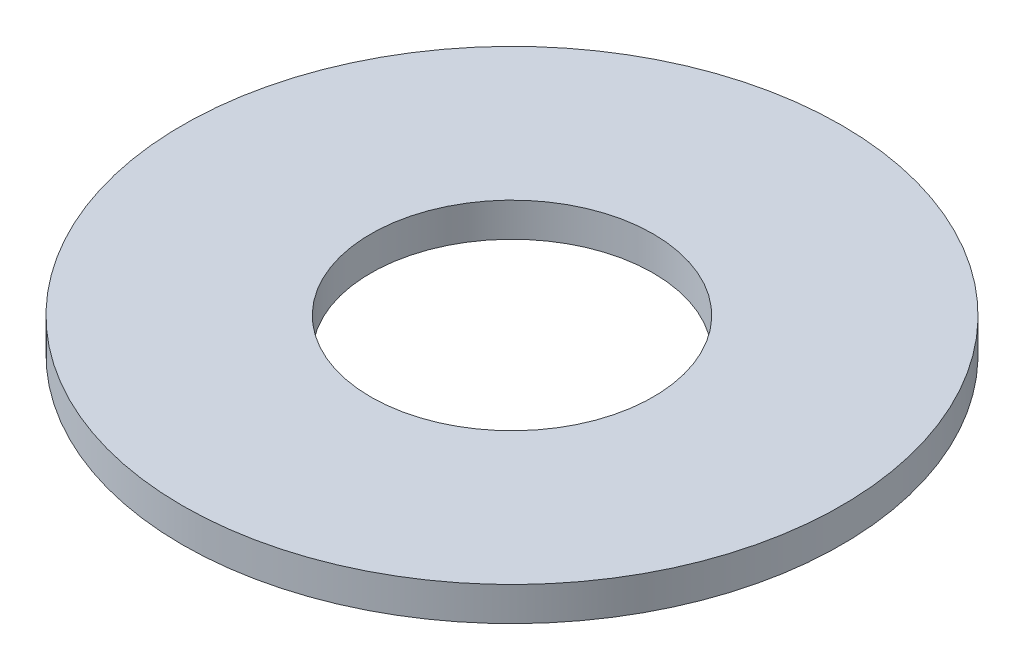
ISO-10303-21;
HEADER;
FILE_DESCRIPTION(('STEP AP214'),'2;1');
FILE_NAME('part.step','',(''),(''),'','','');
FILE_SCHEMA(('AUTOMOTIVE_DESIGN { 1 0 10303 214 1 1 1 1 }'));
ENDSEC;
DATA;
#1=APPLICATION_CONTEXT('core data for automotive mechanical design processes');
#2=APPLICATION_PROTOCOL_DEFINITION('international standard','automotive_design',2000,#1);
#3=PRODUCT_CONTEXT('',#1,'mechanical');
#4=PRODUCT('Part','Part','',(#3));
#5=PRODUCT_RELATED_PRODUCT_CATEGORY('part','',(#4));
#6=PRODUCT_DEFINITION_FORMATION('','',#4);
#7=PRODUCT_DEFINITION_CONTEXT('part definition',#1,'design');
#8=PRODUCT_DEFINITION('design','',#6,#7);
#9=PRODUCT_DEFINITION_SHAPE('','',#8);
#10=(LENGTH_UNIT() NAMED_UNIT(*) SI_UNIT(.MILLI.,.METRE.));
#11=(NAMED_UNIT(*) PLANE_ANGLE_UNIT() SI_UNIT($,.RADIAN.));
#12=(NAMED_UNIT(*) SI_UNIT($,.STERADIAN.) SOLID_ANGLE_UNIT());
#13=UNCERTAINTY_MEASURE_WITH_UNIT(LENGTH_MEASURE(1.E-05),#10,'distance_accuracy_value','');
#14=(GEOMETRIC_REPRESENTATION_CONTEXT(3) GLOBAL_UNCERTAINTY_ASSIGNED_CONTEXT((#13)) GLOBAL_UNIT_ASSIGNED_CONTEXT((#10,
#11,#12)) REPRESENTATION_CONTEXT('',''));
#15=CARTESIAN_POINT('',(0.,0.,0.));
#16=DIRECTION('',(0.,0.,1.));
#17=DIRECTION('',(1.,0.,0.));
#18=AXIS2_PLACEMENT_3D('',#15,#16,#17);
#19=CARTESIAN_POINT('',(0.,9.,0.));
#20=DIRECTION('',(0.,-1.,0.));
#21=DIRECTION('',(0.,0.,-1.));
#22=AXIS2_PLACEMENT_3D('',#19,#20,#21);
#23=CYLINDRICAL_SURFACE('',#22,87.5);
#24=CARTESIAN_POINT('',(0.,9.,0.));
#25=DIRECTION('',(0.,1.,0.));
#26=DIRECTION('',(0.,0.,1.));
#27=AXIS2_PLACEMENT_3D('',#24,#25,#26);
#28=CIRCLE('',#27,87.5);
#29=CARTESIAN_POINT('',(0.,9.,87.5));
#30=VERTEX_POINT('',#29);
#31=EDGE_CURVE('E10',#30,#30,#28,.T.);
#32=ORIENTED_EDGE('',*,*,#31,.F.);
#33=EDGE_LOOP('',(#32));
#34=FACE_BOUND('',#33,.T.);
#35=CARTESIAN_POINT('',(0.,0.,0.));
#36=DIRECTION('',(0.,1.,0.));
#37=DIRECTION('',(0.,0.,1.));
#38=AXIS2_PLACEMENT_3D('',#35,#36,#37);
#39=CIRCLE('',#38,87.5);
#40=CARTESIAN_POINT('',(0.,0.,87.5));
#41=VERTEX_POINT('',#40);
#42=EDGE_CURVE('E37',#41,#41,#39,.T.);
#43=ORIENTED_EDGE('',*,*,#42,.T.);
#44=EDGE_LOOP('',(#43));
#45=FACE_BOUND('',#44,.T.);
#46=ADVANCED_FACE('F40',(#34,#45),#23,.T.);
#47=CARTESIAN_POINT('',(0.,9.,0.));
#48=DIRECTION('',(0.,1.,0.));
#49=DIRECTION('',(0.,0.,1.));
#50=AXIS2_PLACEMENT_3D('',#47,#48,#49);
#51=PLANE('',#50);
#52=CARTESIAN_POINT('',(0.,9.,0.));
#53=DIRECTION('',(0.,1.,0.));
#54=DIRECTION('',(0.,0.,1.));
#55=AXIS2_PLACEMENT_3D('',#52,#53,#54);
#56=CIRCLE('',#55,37.5);
#57=CARTESIAN_POINT('',(0.,9.,37.5));
#58=VERTEX_POINT('',#57);
#59=EDGE_CURVE('E50',#58,#58,#56,.T.);
#60=ORIENTED_EDGE('',*,*,#59,.F.);
#61=EDGE_LOOP('',(#60));
#62=FACE_BOUND('',#61,.T.);
#63=ORIENTED_EDGE('',*,*,#31,.T.);
#64=EDGE_LOOP('',(#63));
#65=FACE_BOUND('',#64,.T.);
#66=ADVANCED_FACE('F59',(#62,#65),#51,.T.);
#67=CARTESIAN_POINT('',(0.,0.,0.));
#68=DIRECTION('',(0.,1.,0.));
#69=DIRECTION('',(0.,0.,1.));
#70=AXIS2_PLACEMENT_3D('',#67,#68,#69);
#71=PLANE('',#70);
#72=CARTESIAN_POINT('',(0.,0.,0.));
#73=DIRECTION('',(0.,1.,0.));
#74=DIRECTION('',(0.,0.,1.));
#75=AXIS2_PLACEMENT_3D('',#72,#73,#74);
#76=CIRCLE('',#75,37.5);
#77=CARTESIAN_POINT('',(0.,0.,37.5));
#78=VERTEX_POINT('',#77);
#79=EDGE_CURVE('E47',#78,#78,#76,.T.);
#80=ORIENTED_EDGE('',*,*,#79,.T.);
#81=EDGE_LOOP('',(#80));
#82=FACE_BOUND('',#81,.T.);
#83=ORIENTED_EDGE('',*,*,#42,.F.);
#84=EDGE_LOOP('',(#83));
#85=FACE_BOUND('',#84,.T.);
#86=ADVANCED_FACE('F58',(#82,#85),#71,.F.);
#87=CARTESIAN_POINT('',(0.,9.,0.));
#88=DIRECTION('',(0.,-1.,0.));
#89=DIRECTION('',(0.,0.,-1.));
#90=AXIS2_PLACEMENT_3D('',#87,#88,#89);
#91=CYLINDRICAL_SURFACE('',#90,37.5);
#92=ORIENTED_EDGE('',*,*,#59,.T.);
#93=EDGE_LOOP('',(#92));
#94=FACE_BOUND('',#93,.T.);
#95=ORIENTED_EDGE('',*,*,#79,.F.);
#96=EDGE_LOOP('',(#95));
#97=FACE_BOUND('',#96,.T.);
#98=ADVANCED_FACE('F54',(#94,#97),#91,.F.);
#99=CLOSED_SHELL('',(#46,#66,#86,#98));
#100=MANIFOLD_SOLID_BREP('B2',#99);
#101=ADVANCED_BREP_SHAPE_REPRESENTATION('',(#18,#100),#14);
#102=SHAPE_DEFINITION_REPRESENTATION(#9,#101);
ENDSEC;
END-ISO-10303-21;
